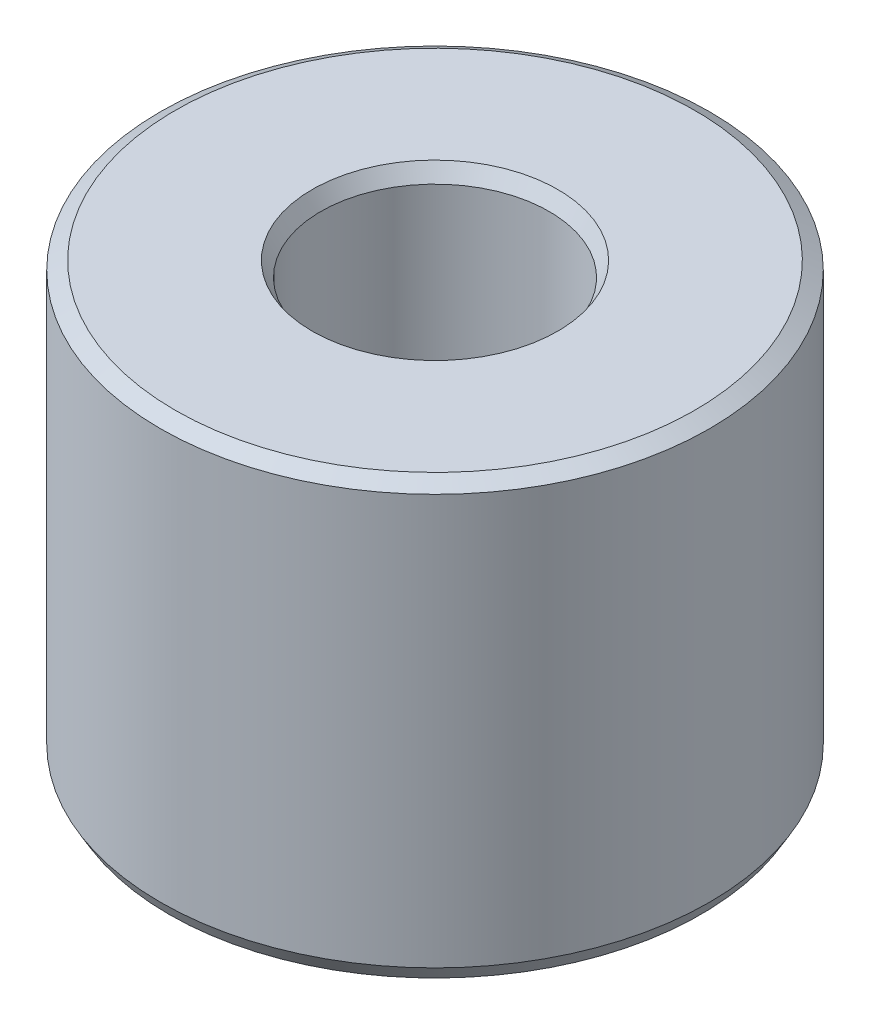
ISO-10303-21;
HEADER;
FILE_DESCRIPTION(('STEP AP214'),'2;1');
FILE_NAME('part.step','',(''),(''),'','','');
FILE_SCHEMA(('AUTOMOTIVE_DESIGN { 1 0 10303 214 1 1 1 1 }'));
ENDSEC;
DATA;
#1=APPLICATION_CONTEXT('core data for automotive mechanical design processes');
#2=APPLICATION_PROTOCOL_DEFINITION('international standard','automotive_design',2000,#1);
#3=PRODUCT_CONTEXT('',#1,'mechanical');
#4=PRODUCT('Part','Part','',(#3));
#5=PRODUCT_RELATED_PRODUCT_CATEGORY('part','',(#4));
#6=PRODUCT_DEFINITION_FORMATION('','',#4);
#7=PRODUCT_DEFINITION_CONTEXT('part definition',#1,'design');
#8=PRODUCT_DEFINITION('design','',#6,#7);
#9=PRODUCT_DEFINITION_SHAPE('','',#8);
#10=(LENGTH_UNIT() NAMED_UNIT(*) SI_UNIT(.MILLI.,.METRE.));
#11=(NAMED_UNIT(*) PLANE_ANGLE_UNIT() SI_UNIT($,.RADIAN.));
#12=(NAMED_UNIT(*) SI_UNIT($,.STERADIAN.) SOLID_ANGLE_UNIT());
#13=UNCERTAINTY_MEASURE_WITH_UNIT(LENGTH_MEASURE(1.E-05),#10,'distance_accuracy_value','');
#14=(GEOMETRIC_REPRESENTATION_CONTEXT(3) GLOBAL_UNCERTAINTY_ASSIGNED_CONTEXT((#13)) GLOBAL_UNIT_ASSIGNED_CONTEXT((#10,
#11,#12)) REPRESENTATION_CONTEXT('',''));
#15=CARTESIAN_POINT('',(0.,0.,0.));
#16=DIRECTION('',(0.,0.,1.));
#17=DIRECTION('',(1.,0.,0.));
#18=AXIS2_PLACEMENT_3D('',#15,#16,#17);
#19=CARTESIAN_POINT('',(0.,63.1463874879992,0.));
#20=DIRECTION('',(0.,-1.,0.));
#21=DIRECTION('',(0.,0.,-1.));
#22=AXIS2_PLACEMENT_3D('',#19,#20,#21);
#23=CYLINDRICAL_SURFACE('',#22,40.);
#24=CARTESIAN_POINT('',(0.,2.15469954632325,0.));
#25=DIRECTION('',(0.,1.,0.));
#26=DIRECTION('',(0.,0.,1.));
#27=AXIS2_PLACEMENT_3D('',#24,#25,#26);
#28=CIRCLE('',#27,40.);
#29=CARTESIAN_POINT('',(0.,2.15469954632325,40.));
#30=VERTEX_POINT('',#29);
#31=EDGE_CURVE('E10',#30,#30,#28,.T.);
#32=ORIENTED_EDGE('',*,*,#31,.T.);
#33=EDGE_LOOP('',(#32));
#34=FACE_BOUND('',#33,.T.);
#35=CARTESIAN_POINT('',(0.,61.9023711249066,0.));
#36=DIRECTION('',(0.,1.,0.));
#37=DIRECTION('',(0.,0.,1.));
#38=AXIS2_PLACEMENT_3D('',#35,#36,#37);
#39=CIRCLE('',#38,40.);
#40=CARTESIAN_POINT('',(0.,61.9023711249066,40.));
#41=VERTEX_POINT('',#40);
#42=EDGE_CURVE('E50',#41,#41,#39,.F.);
#43=ORIENTED_EDGE('',*,*,#42,.T.);
#44=EDGE_LOOP('',(#43));
#45=FACE_BOUND('',#44,.T.);
#46=ADVANCED_FACE('F39',(#34,#45),#23,.T.);
#47=CARTESIAN_POINT('',(0.,63.1463874879992,0.));
#48=DIRECTION('',(0.,1.,0.));
#49=DIRECTION('',(0.,0.,1.));
#50=AXIS2_PLACEMENT_3D('',#47,#48,#49);
#51=PLANE('',#50);
#52=CARTESIAN_POINT('',(0.,63.1463874879992,0.));
#53=DIRECTION('',(0.,1.,0.));
#54=DIRECTION('',(0.,0.,1.));
#55=AXIS2_PLACEMENT_3D('',#52,#53,#54);
#56=CIRCLE('',#55,17.8881981875182);
#57=CARTESIAN_POINT('',(0.,63.1463874879992,17.8881981875182));
#58=VERTEX_POINT('',#57);
#59=EDGE_CURVE('E58',#58,#58,#56,.F.);
#60=ORIENTED_EDGE('',*,*,#59,.T.);
#61=EDGE_LOOP('',(#60));
#62=FACE_BOUND('',#61,.T.);
#63=CARTESIAN_POINT('',(0.,63.1463874879992,0.));
#64=DIRECTION('',(0.,1.,0.));
#65=DIRECTION('',(0.,0.,1.));
#66=AXIS2_PLACEMENT_3D('',#63,#64,#65);
#67=CIRCLE('',#66,37.8453004536767);
#68=CARTESIAN_POINT('',(0.,63.1463874879992,37.8453004536767));
#69=VERTEX_POINT('',#68);
#70=EDGE_CURVE('E61',#69,#69,#67,.T.);
#71=ORIENTED_EDGE('',*,*,#70,.T.);
#72=EDGE_LOOP('',(#71));
#73=FACE_BOUND('',#72,.T.);
#74=ADVANCED_FACE('F88',(#62,#73),#51,.T.);
#75=CARTESIAN_POINT('',(0.,0.,0.));
#76=DIRECTION('',(0.,1.,0.));
#77=DIRECTION('',(0.,0.,1.));
#78=AXIS2_PLACEMENT_3D('',#75,#76,#77);
#79=PLANE('',#78);
#80=CARTESIAN_POINT('',(0.,0.,0.));
#81=DIRECTION('',(0.,1.,0.));
#82=DIRECTION('',(0.,0.,1.));
#83=AXIS2_PLACEMENT_3D('',#80,#81,#82);
#84=CIRCLE('',#83,18.798881370749);
#85=CARTESIAN_POINT('',(0.,0.,18.798881370749));
#86=VERTEX_POINT('',#85);
#87=EDGE_CURVE('E51',#86,#86,#84,.T.);
#88=ORIENTED_EDGE('',*,*,#87,.T.);
#89=EDGE_LOOP('',(#88));
#90=FACE_BOUND('',#89,.T.);
#91=CARTESIAN_POINT('',(0.,0.,0.));
#92=DIRECTION('',(0.,1.,0.));
#93=DIRECTION('',(0.,0.,1.));
#94=AXIS2_PLACEMENT_3D('',#91,#92,#93);
#95=CIRCLE('',#94,38.7559836369075);
#96=CARTESIAN_POINT('',(0.,0.,38.7559836369075));
#97=VERTEX_POINT('',#96);
#98=EDGE_CURVE('E54',#97,#97,#95,.F.);
#99=ORIENTED_EDGE('',*,*,#98,.T.);
#100=EDGE_LOOP('',(#99));
#101=FACE_BOUND('',#100,.T.);
#102=ADVANCED_FACE('F83',(#90,#101),#79,.F.);
#103=CARTESIAN_POINT('',(0.,63.1463874879992,0.));
#104=DIRECTION('',(0.,-1.,0.));
#105=DIRECTION('',(0.,0.,-1.));
#106=AXIS2_PLACEMENT_3D('',#103,#104,#105);
#107=CYLINDRICAL_SURFACE('',#106,16.6441818244257);
#108=CARTESIAN_POINT('',(0.,60.991687941676,0.));
#109=DIRECTION('',(0.,1.,0.));
#110=DIRECTION('',(0.,0.,1.));
#111=AXIS2_PLACEMENT_3D('',#108,#109,#110);
#112=CIRCLE('',#111,16.6441818244257);
#113=CARTESIAN_POINT('',(0.,60.991687941676,16.6441818244257));
#114=VERTEX_POINT('',#113);
#115=EDGE_CURVE('E67',#114,#114,#112,.T.);
#116=ORIENTED_EDGE('',*,*,#115,.T.);
#117=EDGE_LOOP('',(#116));
#118=FACE_BOUND('',#117,.T.);
#119=CARTESIAN_POINT('',(0.,1.24401636309251,0.));
#120=DIRECTION('',(0.,1.,0.));
#121=DIRECTION('',(0.,0.,1.));
#122=AXIS2_PLACEMENT_3D('',#119,#120,#121);
#123=CIRCLE('',#122,16.6441818244257);
#124=CARTESIAN_POINT('',(0.,1.24401636309251,16.6441818244257));
#125=VERTEX_POINT('',#124);
#126=EDGE_CURVE('E69',#125,#125,#123,.F.);
#127=ORIENTED_EDGE('',*,*,#126,.T.);
#128=EDGE_LOOP('',(#127));
#129=FACE_BOUND('',#128,.T.);
#130=ADVANCED_FACE('F71',(#118,#129),#107,.F.);
#131=CARTESIAN_POINT('',(0.,60.991687941676,0.));
#132=DIRECTION('',(0.,1.,0.));
#133=DIRECTION('',(0.,0.,1.));
#134=AXIS2_PLACEMENT_3D('',#131,#132,#133);
#135=CONICAL_SURFACE('',#134,16.6441818244257,0.5235987755983);
#136=ORIENTED_EDGE('',*,*,#59,.F.);
#137=EDGE_LOOP('',(#136));
#138=FACE_BOUND('',#137,.T.);
#139=ORIENTED_EDGE('',*,*,#115,.F.);
#140=EDGE_LOOP('',(#139));
#141=FACE_BOUND('',#140,.T.);
#142=ADVANCED_FACE('F77',(#138,#141),#135,.F.);
#143=CARTESIAN_POINT('',(0.,0.,0.));
#144=DIRECTION('',(0.,-1.,0.));
#145=DIRECTION('',(0.,0.,-1.));
#146=AXIS2_PLACEMENT_3D('',#143,#144,#145);
#147=CONICAL_SURFACE('',#146,18.798881370749,1.0471975511966);
#148=ORIENTED_EDGE('',*,*,#126,.F.);
#149=EDGE_LOOP('',(#148));
#150=FACE_BOUND('',#149,.T.);
#151=ORIENTED_EDGE('',*,*,#87,.F.);
#152=EDGE_LOOP('',(#151));
#153=FACE_BOUND('',#152,.T.);
#154=ADVANCED_FACE('F73',(#150,#153),#147,.F.);
#155=CARTESIAN_POINT('',(0.,2.15469954632325,0.));
#156=DIRECTION('',(0.,1.,0.));
#157=DIRECTION('',(0.,0.,1.));
#158=AXIS2_PLACEMENT_3D('',#155,#156,#157);
#159=CONICAL_SURFACE('',#158,40.,0.523598775598302);
#160=ORIENTED_EDGE('',*,*,#98,.F.);
#161=EDGE_LOOP('',(#160));
#162=FACE_BOUND('',#161,.T.);
#163=ORIENTED_EDGE('',*,*,#31,.F.);
#164=EDGE_LOOP('',(#163));
#165=FACE_BOUND('',#164,.T.);
#166=ADVANCED_FACE('F76',(#162,#165),#159,.T.);
#167=CARTESIAN_POINT('',(0.,63.1463874879992,0.));
#168=DIRECTION('',(0.,-1.,0.));
#169=DIRECTION('',(0.,0.,-1.));
#170=AXIS2_PLACEMENT_3D('',#167,#168,#169);
#171=CONICAL_SURFACE('',#170,37.8453004536767,1.04719755119659);
#172=ORIENTED_EDGE('',*,*,#42,.F.);
#173=EDGE_LOOP('',(#172));
#174=FACE_BOUND('',#173,.T.);
#175=ORIENTED_EDGE('',*,*,#70,.F.);
#176=EDGE_LOOP('',(#175));
#177=FACE_BOUND('',#176,.T.);
#178=ADVANCED_FACE('F45',(#174,#177),#171,.T.);
#179=CLOSED_SHELL('',(#46,#74,#102,#130,#142,#154,#166,#178));
#180=MANIFOLD_SOLID_BREP('B2',#179);
#181=ADVANCED_BREP_SHAPE_REPRESENTATION('',(#18,#180),#14);
#182=SHAPE_DEFINITION_REPRESENTATION(#9,#181);
ENDSEC;
END-ISO-10303-21;
